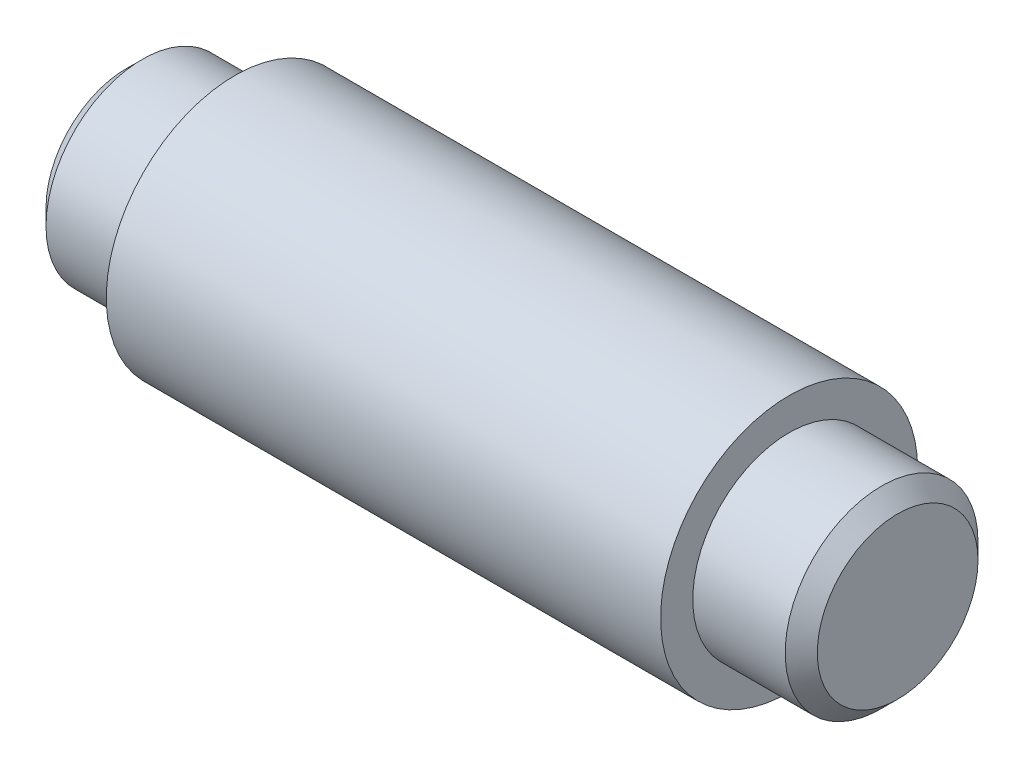
ISO-10303-21;
HEADER;
FILE_DESCRIPTION(('STEP AP214'),'2;1');
FILE_NAME('part.step','',(''),(''),'','','');
FILE_SCHEMA(('AUTOMOTIVE_DESIGN { 1 0 10303 214 1 1 1 1 }'));
ENDSEC;
DATA;
#1=APPLICATION_CONTEXT('core data for automotive mechanical design processes');
#2=APPLICATION_PROTOCOL_DEFINITION('international standard','automotive_design',2000,#1);
#3=PRODUCT_CONTEXT('',#1,'mechanical');
#4=PRODUCT('Part','Part','',(#3));
#5=PRODUCT_RELATED_PRODUCT_CATEGORY('part','',(#4));
#6=PRODUCT_DEFINITION_FORMATION('','',#4);
#7=PRODUCT_DEFINITION_CONTEXT('part definition',#1,'design');
#8=PRODUCT_DEFINITION('design','',#6,#7);
#9=PRODUCT_DEFINITION_SHAPE('','',#8);
#10=(LENGTH_UNIT() NAMED_UNIT(*) SI_UNIT(.MILLI.,.METRE.));
#11=(NAMED_UNIT(*) PLANE_ANGLE_UNIT() SI_UNIT($,.RADIAN.));
#12=(NAMED_UNIT(*) SI_UNIT($,.STERADIAN.) SOLID_ANGLE_UNIT());
#13=UNCERTAINTY_MEASURE_WITH_UNIT(LENGTH_MEASURE(1.E-05),#10,'distance_accuracy_value','');
#14=(GEOMETRIC_REPRESENTATION_CONTEXT(3) GLOBAL_UNCERTAINTY_ASSIGNED_CONTEXT((#13)) GLOBAL_UNIT_ASSIGNED_CONTEXT((#10,
#11,#12)) REPRESENTATION_CONTEXT('',''));
#15=CARTESIAN_POINT('',(0.,0.,0.));
#16=DIRECTION('',(0.,0.,1.));
#17=DIRECTION('',(1.,0.,0.));
#18=AXIS2_PLACEMENT_3D('',#15,#16,#17);
#19=CARTESIAN_POINT('',(0.,0.,0.));
#20=DIRECTION('',(-1.,0.,0.));
#21=DIRECTION('',(0.,0.,1.));
#22=AXIS2_PLACEMENT_3D('',#19,#20,#21);
#23=PLANE('',#22);
#24=CARTESIAN_POINT('',(0.,0.,0.));
#25=DIRECTION('',(-1.,0.,0.));
#26=DIRECTION('',(0.,0.,1.));
#27=AXIS2_PLACEMENT_3D('',#24,#25,#26);
#28=CIRCLE('',#27,7.93749999999997);
#29=CARTESIAN_POINT('',(0.,0.,7.93749999999997));
#30=VERTEX_POINT('',#29);
#31=EDGE_CURVE('E10',#30,#30,#28,.T.);
#32=ORIENTED_EDGE('',*,*,#31,.T.);
#33=EDGE_LOOP('',(#32));
#34=FACE_BOUND('',#33,.T.);
#35=ADVANCED_FACE('F40',(#34),#23,.T.);
#36=CARTESIAN_POINT('',(76.2,0.,0.));
#37=DIRECTION('',(1.,0.,0.));
#38=DIRECTION('',(0.,0.,-1.));
#39=AXIS2_PLACEMENT_3D('',#36,#37,#38);
#40=CYLINDRICAL_SURFACE('',#39,9.52499999999999);
#41=CARTESIAN_POINT('',(1.58750000000002,0.,0.));
#42=DIRECTION('',(-1.,0.,0.));
#43=DIRECTION('',(0.,0.,1.));
#44=AXIS2_PLACEMENT_3D('',#41,#42,#43);
#45=CIRCLE('',#44,9.52499999999999);
#46=CARTESIAN_POINT('',(1.58750000000002,0.,9.52499999999999));
#47=VERTEX_POINT('',#46);
#48=EDGE_CURVE('E49',#47,#47,#45,.F.);
#49=ORIENTED_EDGE('',*,*,#48,.T.);
#50=EDGE_LOOP('',(#49));
#51=FACE_BOUND('',#50,.T.);
#52=CARTESIAN_POINT('',(10.7188,0.,0.));
#53=DIRECTION('',(1.,0.,0.));
#54=DIRECTION('',(0.,0.,-1.));
#55=AXIS2_PLACEMENT_3D('',#52,#53,#54);
#56=CIRCLE('',#55,9.52499999999999);
#57=CARTESIAN_POINT('',(10.7188,0.,-9.52499999999999));
#58=VERTEX_POINT('',#57);
#59=EDGE_CURVE('E65',#58,#58,#56,.T.);
#60=ORIENTED_EDGE('',*,*,#59,.F.);
#61=EDGE_LOOP('',(#60));
#62=FACE_BOUND('',#61,.T.);
#63=ADVANCED_FACE('F100',(#51,#62),#40,.T.);
#64=CARTESIAN_POINT('',(10.7188,9.52500000000001,0.));
#65=DIRECTION('',(-1.,0.,0.));
#66=DIRECTION('',(0.,0.,1.));
#67=AXIS2_PLACEMENT_3D('',#64,#65,#66);
#68=PLANE('',#67);
#69=ORIENTED_EDGE('',*,*,#59,.T.);
#70=EDGE_LOOP('',(#69));
#71=FACE_BOUND('',#70,.T.);
#72=CARTESIAN_POINT('',(10.7188,0.,0.));
#73=DIRECTION('',(1.,0.,0.));
#74=DIRECTION('',(0.,0.,-1.));
#75=AXIS2_PLACEMENT_3D('',#72,#73,#74);
#76=CIRCLE('',#75,12.7);
#77=CARTESIAN_POINT('',(10.7188,0.,-12.7));
#78=VERTEX_POINT('',#77);
#79=EDGE_CURVE('E69',#78,#78,#76,.T.);
#80=ORIENTED_EDGE('',*,*,#79,.F.);
#81=EDGE_LOOP('',(#80));
#82=FACE_BOUND('',#81,.T.);
#83=ADVANCED_FACE('F96',(#71,#82),#68,.T.);
#84=CARTESIAN_POINT('',(76.2,0.,0.));
#85=DIRECTION('',(1.,0.,0.));
#86=DIRECTION('',(0.,0.,-1.));
#87=AXIS2_PLACEMENT_3D('',#84,#85,#86);
#88=CYLINDRICAL_SURFACE('',#87,12.7);
#89=ORIENTED_EDGE('',*,*,#79,.T.);
#90=EDGE_LOOP('',(#89));
#91=FACE_BOUND('',#90,.T.);
#92=CARTESIAN_POINT('',(65.4812,0.,0.));
#93=DIRECTION('',(1.,0.,0.));
#94=DIRECTION('',(0.,0.,-1.));
#95=AXIS2_PLACEMENT_3D('',#92,#93,#94);
#96=CIRCLE('',#95,12.7);
#97=CARTESIAN_POINT('',(65.4812,0.,-12.7));
#98=VERTEX_POINT('',#97);
#99=EDGE_CURVE('E73',#98,#98,#96,.T.);
#100=ORIENTED_EDGE('',*,*,#99,.F.);
#101=EDGE_LOOP('',(#100));
#102=FACE_BOUND('',#101,.T.);
#103=ADVANCED_FACE('F86',(#91,#102),#88,.T.);
#104=CARTESIAN_POINT('',(65.4812,12.7,0.));
#105=DIRECTION('',(1.,0.,0.));
#106=DIRECTION('',(0.,0.,-1.));
#107=AXIS2_PLACEMENT_3D('',#104,#105,#106);
#108=PLANE('',#107);
#109=ORIENTED_EDGE('',*,*,#99,.T.);
#110=EDGE_LOOP('',(#109));
#111=FACE_BOUND('',#110,.T.);
#112=CARTESIAN_POINT('',(65.4812,0.,0.));
#113=DIRECTION('',(1.,0.,0.));
#114=DIRECTION('',(0.,0.,-1.));
#115=AXIS2_PLACEMENT_3D('',#112,#113,#114);
#116=CIRCLE('',#115,9.525);
#117=CARTESIAN_POINT('',(65.4812,0.,-9.525));
#118=VERTEX_POINT('',#117);
#119=EDGE_CURVE('E77',#118,#118,#116,.T.);
#120=ORIENTED_EDGE('',*,*,#119,.F.);
#121=EDGE_LOOP('',(#120));
#122=FACE_BOUND('',#121,.T.);
#123=ADVANCED_FACE('F84',(#111,#122),#108,.T.);
#124=CARTESIAN_POINT('',(76.2,0.,0.));
#125=DIRECTION('',(1.,0.,0.));
#126=DIRECTION('',(0.,0.,-1.));
#127=AXIS2_PLACEMENT_3D('',#124,#125,#126);
#128=CYLINDRICAL_SURFACE('',#127,9.525);
#129=CARTESIAN_POINT('',(74.6125,0.,0.));
#130=DIRECTION('',(1.,0.,0.));
#131=DIRECTION('',(0.,0.,-1.));
#132=AXIS2_PLACEMENT_3D('',#129,#130,#131);
#133=CIRCLE('',#132,9.525);
#134=CARTESIAN_POINT('',(74.6125,0.,-9.525));
#135=VERTEX_POINT('',#134);
#136=EDGE_CURVE('E54',#135,#135,#133,.F.);
#137=ORIENTED_EDGE('',*,*,#136,.T.);
#138=EDGE_LOOP('',(#137));
#139=FACE_BOUND('',#138,.T.);
#140=ORIENTED_EDGE('',*,*,#119,.T.);
#141=EDGE_LOOP('',(#140));
#142=FACE_BOUND('',#141,.T.);
#143=ADVANCED_FACE('F82',(#139,#142),#128,.T.);
#144=CARTESIAN_POINT('',(76.2,9.52500000000001,0.));
#145=DIRECTION('',(1.,0.,0.));
#146=DIRECTION('',(0.,0.,-1.));
#147=AXIS2_PLACEMENT_3D('',#144,#145,#146);
#148=PLANE('',#147);
#149=CARTESIAN_POINT('',(76.2,0.,0.));
#150=DIRECTION('',(1.,0.,0.));
#151=DIRECTION('',(0.,0.,-1.));
#152=AXIS2_PLACEMENT_3D('',#149,#150,#151);
#153=CIRCLE('',#152,7.93749999999999);
#154=CARTESIAN_POINT('',(76.2,0.,-7.93749999999999));
#155=VERTEX_POINT('',#154);
#156=EDGE_CURVE('E59',#155,#155,#153,.T.);
#157=ORIENTED_EDGE('',*,*,#156,.T.);
#158=EDGE_LOOP('',(#157));
#159=FACE_BOUND('',#158,.T.);
#160=ADVANCED_FACE('F93',(#159),#148,.T.);
#161=CARTESIAN_POINT('',(76.2,0.,0.));
#162=DIRECTION('',(-1.,0.,0.));
#163=DIRECTION('',(0.,0.,1.));
#164=AXIS2_PLACEMENT_3D('',#161,#162,#163);
#165=CONICAL_SURFACE('',#164,7.93749999999999,0.78539816339744);
#166=ORIENTED_EDGE('',*,*,#136,.F.);
#167=EDGE_LOOP('',(#166));
#168=FACE_BOUND('',#167,.T.);
#169=ORIENTED_EDGE('',*,*,#156,.F.);
#170=EDGE_LOOP('',(#169));
#171=FACE_BOUND('',#170,.T.);
#172=ADVANCED_FACE('F108',(#168,#171),#165,.T.);
#173=CARTESIAN_POINT('',(1.58750000000002,0.,0.));
#174=DIRECTION('',(1.,0.,0.));
#175=DIRECTION('',(0.,0.,-1.));
#176=AXIS2_PLACEMENT_3D('',#173,#174,#175);
#177=CONICAL_SURFACE('',#176,9.52499999999999,0.785398163397448);
#178=ORIENTED_EDGE('',*,*,#31,.F.);
#179=EDGE_LOOP('',(#178));
#180=FACE_BOUND('',#179,.T.);
#181=ORIENTED_EDGE('',*,*,#48,.F.);
#182=EDGE_LOOP('',(#181));
#183=FACE_BOUND('',#182,.T.);
#184=ADVANCED_FACE('F43',(#180,#183),#177,.T.);
#185=CLOSED_SHELL('',(#35,#63,#83,#103,#123,#143,#160,#172,#184));
#186=MANIFOLD_SOLID_BREP('B2',#185);
#187=ADVANCED_BREP_SHAPE_REPRESENTATION('',(#18,#186),#14);
#188=SHAPE_DEFINITION_REPRESENTATION(#9,#187);
ENDSEC;
END-ISO-10303-21;
